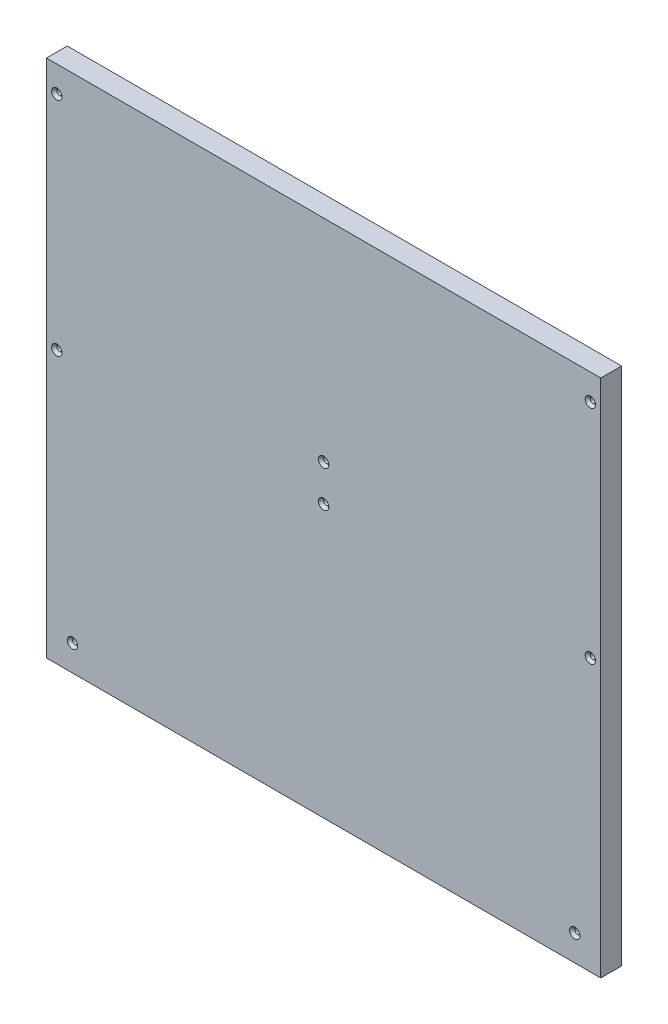
ISO-10303-21;
HEADER;
FILE_DESCRIPTION(('STEP AP214'),'2;1');
FILE_NAME('part.step','',(''),(''),'','','');
FILE_SCHEMA(('AUTOMOTIVE_DESIGN { 1 0 10303 214 1 1 1 1 }'));
ENDSEC;
DATA;
#1=APPLICATION_CONTEXT('core data for automotive mechanical design processes');
#2=APPLICATION_PROTOCOL_DEFINITION('international standard','automotive_design',2000,#1);
#3=PRODUCT_CONTEXT('',#1,'mechanical');
#4=PRODUCT('Part','Part','',(#3));
#5=PRODUCT_RELATED_PRODUCT_CATEGORY('part','',(#4));
#6=PRODUCT_DEFINITION_FORMATION('','',#4);
#7=PRODUCT_DEFINITION_CONTEXT('part definition',#1,'design');
#8=PRODUCT_DEFINITION('design','',#6,#7);
#9=PRODUCT_DEFINITION_SHAPE('','',#8);
#10=(LENGTH_UNIT() NAMED_UNIT(*) SI_UNIT(.MILLI.,.METRE.));
#11=(NAMED_UNIT(*) PLANE_ANGLE_UNIT() SI_UNIT($,.RADIAN.));
#12=(NAMED_UNIT(*) SI_UNIT($,.STERADIAN.) SOLID_ANGLE_UNIT());
#13=UNCERTAINTY_MEASURE_WITH_UNIT(LENGTH_MEASURE(1.E-05),#10,'distance_accuracy_value','');
#14=(GEOMETRIC_REPRESENTATION_CONTEXT(3) GLOBAL_UNCERTAINTY_ASSIGNED_CONTEXT((#13)) GLOBAL_UNIT_ASSIGNED_CONTEXT((#10,
#11,#12)) REPRESENTATION_CONTEXT('',''));
#15=CARTESIAN_POINT('',(0.,0.,0.));
#16=DIRECTION('',(0.,0.,1.));
#17=DIRECTION('',(1.,0.,0.));
#18=AXIS2_PLACEMENT_3D('',#15,#16,#17);
#19=CARTESIAN_POINT('',(0.,0.,12.));
#20=DIRECTION('',(0.,0.,1.));
#21=DIRECTION('',(1.,0.,0.));
#22=AXIS2_PLACEMENT_3D('',#19,#20,#21);
#23=PLANE('',#22);
#24=CARTESIAN_POINT('',(14.5077720207254,97.7253886010362,12.));
#25=DIRECTION('',(0.,0.,1.));
#26=DIRECTION('',(1.,0.,0.));
#27=AXIS2_PLACEMENT_3D('',#24,#25,#26);
#28=CIRCLE('',#27,3.);
#29=CARTESIAN_POINT('',(17.5077720207254,97.7253886010362,12.));
#30=VERTEX_POINT('',#29);
#31=EDGE_CURVE('E388',#30,#30,#28,.T.);
#32=ORIENTED_EDGE('',*,*,#31,.F.);
#33=EDGE_LOOP('',(#32));
#34=FACE_BOUND('',#33,.T.);
#35=CARTESIAN_POINT('',(159.507772020725,-44.2746113989638,12.));
#36=DIRECTION('',(0.,0.,1.));
#37=DIRECTION('',(1.,0.,0.));
#38=AXIS2_PLACEMENT_3D('',#35,#36,#37);
#39=CIRCLE('',#38,2.99999999999999);
#40=CARTESIAN_POINT('',(162.507772020725,-44.2746113989638,12.));
#41=VERTEX_POINT('',#40);
#42=EDGE_CURVE('E385',#41,#41,#39,.T.);
#43=ORIENTED_EDGE('',*,*,#42,.F.);
#44=EDGE_LOOP('',(#43));
#45=FACE_BOUND('',#44,.T.);
#46=CARTESIAN_POINT('',(-130.492227979275,-44.2746113989638,12.));
#47=DIRECTION('',(0.,0.,1.));
#48=DIRECTION('',(1.,0.,0.));
#49=AXIS2_PLACEMENT_3D('',#46,#47,#48);
#50=CIRCLE('',#49,2.99999999999999);
#51=CARTESIAN_POINT('',(-127.492227979275,-44.2746113989638,12.));
#52=VERTEX_POINT('',#51);
#53=EDGE_CURVE('E389',#52,#52,#50,.T.);
#54=ORIENTED_EDGE('',*,*,#53,.F.);
#55=EDGE_LOOP('',(#54));
#56=FACE_BOUND('',#55,.T.);
#57=CARTESIAN_POINT('',(14.5077720207254,118.725388601036,12.));
#58=DIRECTION('',(0.,0.,1.));
#59=DIRECTION('',(1.,0.,0.));
#60=AXIS2_PLACEMENT_3D('',#57,#58,#59);
#61=CIRCLE('',#60,3.);
#62=CARTESIAN_POINT('',(17.5077720207254,118.725388601036,12.));
#63=VERTEX_POINT('',#62);
#64=EDGE_CURVE('E392',#63,#63,#61,.T.);
#65=ORIENTED_EDGE('',*,*,#64,.F.);
#66=EDGE_LOOP('',(#65));
#67=FACE_BOUND('',#66,.T.);
#68=CARTESIAN_POINT('',(168.507772020725,97.7253886010362,12.));
#69=DIRECTION('',(0.,0.,1.));
#70=DIRECTION('',(1.,0.,0.));
#71=AXIS2_PLACEMENT_3D('',#68,#69,#70);
#72=CIRCLE('',#71,2.99999999999999);
#73=CARTESIAN_POINT('',(171.507772020725,97.7253886010362,12.));
#74=VERTEX_POINT('',#73);
#75=EDGE_CURVE('E140',#74,#74,#72,.T.);
#76=ORIENTED_EDGE('',*,*,#75,.F.);
#77=EDGE_LOOP('',(#76));
#78=FACE_BOUND('',#77,.T.);
#79=CARTESIAN_POINT('',(168.507772020725,225.725388601036,12.));
#80=DIRECTION('',(0.,0.,1.));
#81=DIRECTION('',(1.,0.,0.));
#82=AXIS2_PLACEMENT_3D('',#79,#80,#81);
#83=CIRCLE('',#82,2.99999999999999);
#84=CARTESIAN_POINT('',(171.507772020725,225.725388601036,12.));
#85=VERTEX_POINT('',#84);
#86=EDGE_CURVE('E381',#85,#85,#83,.T.);
#87=ORIENTED_EDGE('',*,*,#86,.F.);
#88=EDGE_LOOP('',(#87));
#89=FACE_BOUND('',#88,.T.);
#90=CARTESIAN_POINT('',(-139.492227979275,97.7253886010362,12.));
#91=DIRECTION('',(0.,0.,1.));
#92=DIRECTION('',(1.,0.,0.));
#93=AXIS2_PLACEMENT_3D('',#90,#91,#92);
#94=CIRCLE('',#93,2.99999999999999);
#95=CARTESIAN_POINT('',(-136.492227979275,97.7253886010362,12.));
#96=VERTEX_POINT('',#95);
#97=EDGE_CURVE('E116',#96,#96,#94,.T.);
#98=ORIENTED_EDGE('',*,*,#97,.F.);
#99=EDGE_LOOP('',(#98));
#100=FACE_BOUND('',#99,.T.);
#101=CARTESIAN_POINT('',(-139.492227979275,225.725388601036,12.));
#102=DIRECTION('',(0.,0.,1.));
#103=DIRECTION('',(1.,0.,0.));
#104=AXIS2_PLACEMENT_3D('',#101,#102,#103);
#105=CIRCLE('',#104,2.99999999999999);
#106=CARTESIAN_POINT('',(-136.492227979275,225.725388601036,12.));
#107=VERTEX_POINT('',#106);
#108=EDGE_CURVE('E111',#107,#107,#105,.T.);
#109=ORIENTED_EDGE('',*,*,#108,.F.);
#110=EDGE_LOOP('',(#109));
#111=FACE_BOUND('',#110,.T.);
#112=DIRECTION('',(0.,-1.,0.));
#113=VECTOR('',#112,1.);
#114=CARTESIAN_POINT('',(-145.492227979275,240.725388601036,12.));
#115=LINE('',#114,#113);
#116=CARTESIAN_POINT('',(-145.492227979275,240.725388601036,12.));
#117=VERTEX_POINT('',#116);
#118=CARTESIAN_POINT('',(-145.492227979275,-59.2746113989638,12.));
#119=VERTEX_POINT('',#118);
#120=EDGE_CURVE('E85',#117,#119,#115,.T.);
#121=ORIENTED_EDGE('',*,*,#120,.T.);
#122=DIRECTION('',(1.,0.,0.));
#123=VECTOR('',#122,1.);
#124=CARTESIAN_POINT('',(-145.492227979275,-59.2746113989638,12.));
#125=LINE('',#124,#123);
#126=CARTESIAN_POINT('',(174.507772020725,-59.2746113989638,12.));
#127=VERTEX_POINT('',#126);
#128=EDGE_CURVE('E81',#119,#127,#125,.T.);
#129=ORIENTED_EDGE('',*,*,#128,.T.);
#130=DIRECTION('',(0.,1.,0.));
#131=VECTOR('',#130,1.);
#132=CARTESIAN_POINT('',(174.507772020725,240.725388601036,12.));
#133=LINE('',#132,#131);
#134=CARTESIAN_POINT('',(174.507772020725,240.725388601036,12.));
#135=VERTEX_POINT('',#134);
#136=EDGE_CURVE('E83',#127,#135,#133,.T.);
#137=ORIENTED_EDGE('',*,*,#136,.T.);
#138=DIRECTION('',(-1.,0.,0.));
#139=VECTOR('',#138,1.);
#140=CARTESIAN_POINT('',(-145.492227979275,240.725388601036,12.));
#141=LINE('',#140,#139);
#142=EDGE_CURVE('E51',#135,#117,#141,.T.);
#143=ORIENTED_EDGE('',*,*,#142,.T.);
#144=EDGE_LOOP('',(#121,#129,#137,#143));
#145=FACE_BOUND('',#144,.T.);
#146=ADVANCED_FACE('F32',(#34,#45,#56,#67,#78,#89,#100,#111,#145),#23,.T.);
#147=CARTESIAN_POINT('',(0.,0.,0.));
#148=DIRECTION('',(0.,0.,1.));
#149=DIRECTION('',(1.,0.,0.));
#150=AXIS2_PLACEMENT_3D('',#147,#148,#149);
#151=PLANE('',#150);
#152=DIRECTION('',(0.,-1.,0.));
#153=VECTOR('',#152,1.);
#154=CARTESIAN_POINT('',(-145.492227979275,240.725388601036,0.));
#155=LINE('',#154,#153);
#156=CARTESIAN_POINT('',(-145.492227979275,240.725388601036,0.));
#157=VERTEX_POINT('',#156);
#158=CARTESIAN_POINT('',(-145.492227979275,-59.2746113989638,0.));
#159=VERTEX_POINT('',#158);
#160=EDGE_CURVE('E98',#157,#159,#155,.T.);
#161=ORIENTED_EDGE('',*,*,#160,.F.);
#162=DIRECTION('',(-1.,0.,0.));
#163=VECTOR('',#162,1.);
#164=CARTESIAN_POINT('',(-145.492227979275,240.725388601036,0.));
#165=LINE('',#164,#163);
#166=CARTESIAN_POINT('',(174.507772020725,240.725388601036,0.));
#167=VERTEX_POINT('',#166);
#168=EDGE_CURVE('E74',#167,#157,#165,.T.);
#169=ORIENTED_EDGE('',*,*,#168,.F.);
#170=DIRECTION('',(0.,1.,0.));
#171=VECTOR('',#170,1.);
#172=CARTESIAN_POINT('',(174.507772020725,240.725388601036,0.));
#173=LINE('',#172,#171);
#174=CARTESIAN_POINT('',(174.507772020725,-59.2746113989638,0.));
#175=VERTEX_POINT('',#174);
#176=EDGE_CURVE('E68',#175,#167,#173,.T.);
#177=ORIENTED_EDGE('',*,*,#176,.F.);
#178=DIRECTION('',(1.,0.,0.));
#179=VECTOR('',#178,1.);
#180=CARTESIAN_POINT('',(-145.492227979275,-59.2746113989638,0.));
#181=LINE('',#180,#179);
#182=EDGE_CURVE('E89',#159,#175,#181,.T.);
#183=ORIENTED_EDGE('',*,*,#182,.F.);
#184=EDGE_LOOP('',(#161,#169,#177,#183));
#185=FACE_BOUND('',#184,.T.);
#186=CARTESIAN_POINT('',(-139.492227979275,225.725388601036,0.));
#187=DIRECTION('',(0.,0.,1.));
#188=DIRECTION('',(1.,0.,0.));
#189=AXIS2_PLACEMENT_3D('',#186,#187,#188);
#190=CIRCLE('',#189,1.5);
#191=CARTESIAN_POINT('',(-137.992227979275,225.725388601036,0.));
#192=VERTEX_POINT('',#191);
#193=EDGE_CURVE('E101',#192,#192,#190,.T.);
#194=ORIENTED_EDGE('',*,*,#193,.T.);
#195=EDGE_LOOP('',(#194));
#196=FACE_BOUND('',#195,.T.);
#197=CARTESIAN_POINT('',(-139.492227979275,97.7253886010362,0.));
#198=DIRECTION('',(0.,0.,1.));
#199=DIRECTION('',(1.,0.,0.));
#200=AXIS2_PLACEMENT_3D('',#197,#198,#199);
#201=CIRCLE('',#200,1.5);
#202=CARTESIAN_POINT('',(-137.992227979275,97.7253886010362,0.));
#203=VERTEX_POINT('',#202);
#204=EDGE_CURVE('E159',#203,#203,#201,.T.);
#205=ORIENTED_EDGE('',*,*,#204,.T.);
#206=EDGE_LOOP('',(#205));
#207=FACE_BOUND('',#206,.T.);
#208=CARTESIAN_POINT('',(168.507772020725,225.725388601036,0.));
#209=DIRECTION('',(0.,0.,1.));
#210=DIRECTION('',(1.,0.,0.));
#211=AXIS2_PLACEMENT_3D('',#208,#209,#210);
#212=CIRCLE('',#211,1.5);
#213=CARTESIAN_POINT('',(170.007772020725,225.725388601036,0.));
#214=VERTEX_POINT('',#213);
#215=EDGE_CURVE('E156',#214,#214,#212,.T.);
#216=ORIENTED_EDGE('',*,*,#215,.T.);
#217=EDGE_LOOP('',(#216));
#218=FACE_BOUND('',#217,.T.);
#219=CARTESIAN_POINT('',(168.507772020725,97.7253886010362,0.));
#220=DIRECTION('',(0.,0.,1.));
#221=DIRECTION('',(1.,0.,0.));
#222=AXIS2_PLACEMENT_3D('',#219,#220,#221);
#223=CIRCLE('',#222,1.5);
#224=CARTESIAN_POINT('',(170.007772020725,97.7253886010362,0.));
#225=VERTEX_POINT('',#224);
#226=EDGE_CURVE('E153',#225,#225,#223,.T.);
#227=ORIENTED_EDGE('',*,*,#226,.T.);
#228=EDGE_LOOP('',(#227));
#229=FACE_BOUND('',#228,.T.);
#230=CARTESIAN_POINT('',(-130.492227979275,-44.2746113989638,0.));
#231=DIRECTION('',(0.,0.,1.));
#232=DIRECTION('',(1.,0.,0.));
#233=AXIS2_PLACEMENT_3D('',#230,#231,#232);
#234=CIRCLE('',#233,1.5);
#235=CARTESIAN_POINT('',(-128.992227979275,-44.2746113989638,0.));
#236=VERTEX_POINT('',#235);
#237=EDGE_CURVE('E150',#236,#236,#234,.T.);
#238=ORIENTED_EDGE('',*,*,#237,.T.);
#239=EDGE_LOOP('',(#238));
#240=FACE_BOUND('',#239,.T.);
#241=CARTESIAN_POINT('',(159.507772020725,-44.2746113989638,0.));
#242=DIRECTION('',(0.,0.,1.));
#243=DIRECTION('',(1.,0.,0.));
#244=AXIS2_PLACEMENT_3D('',#241,#242,#243);
#245=CIRCLE('',#244,1.5);
#246=CARTESIAN_POINT('',(161.007772020725,-44.2746113989638,0.));
#247=VERTEX_POINT('',#246);
#248=EDGE_CURVE('E147',#247,#247,#245,.T.);
#249=ORIENTED_EDGE('',*,*,#248,.T.);
#250=EDGE_LOOP('',(#249));
#251=FACE_BOUND('',#250,.T.);
#252=CARTESIAN_POINT('',(14.5077720207254,97.7253886010362,0.));
#253=DIRECTION('',(0.,0.,1.));
#254=DIRECTION('',(1.,0.,0.));
#255=AXIS2_PLACEMENT_3D('',#252,#253,#254);
#256=CIRCLE('',#255,1.5);
#257=CARTESIAN_POINT('',(16.0077720207254,97.7253886010362,0.));
#258=VERTEX_POINT('',#257);
#259=EDGE_CURVE('E144',#258,#258,#256,.T.);
#260=ORIENTED_EDGE('',*,*,#259,.T.);
#261=EDGE_LOOP('',(#260));
#262=FACE_BOUND('',#261,.T.);
#263=CARTESIAN_POINT('',(14.5077720207254,118.725388601036,0.));
#264=DIRECTION('',(0.,0.,1.));
#265=DIRECTION('',(1.,0.,0.));
#266=AXIS2_PLACEMENT_3D('',#263,#264,#265);
#267=CIRCLE('',#266,1.5);
#268=CARTESIAN_POINT('',(16.0077720207254,118.725388601036,0.));
#269=VERTEX_POINT('',#268);
#270=EDGE_CURVE('E110',#269,#269,#267,.T.);
#271=ORIENTED_EDGE('',*,*,#270,.T.);
#272=EDGE_LOOP('',(#271));
#273=FACE_BOUND('',#272,.T.);
#274=ADVANCED_FACE('F165',(#185,#196,#207,#218,#229,#240,#251,#262,#273),#151,.F.);
#275=CARTESIAN_POINT('',(-145.492227979275,240.725388601036,12.));
#276=DIRECTION('',(1.,0.,0.));
#277=DIRECTION('',(0.,1.,0.));
#278=AXIS2_PLACEMENT_3D('',#275,#276,#277);
#279=PLANE('',#278);
#280=ORIENTED_EDGE('',*,*,#160,.T.);
#281=DIRECTION('',(0.,0.,-1.));
#282=VECTOR('',#281,1.);
#283=CARTESIAN_POINT('',(-145.492227979275,-59.2746113989638,12.));
#284=LINE('',#283,#282);
#285=EDGE_CURVE('E11',#119,#159,#284,.T.);
#286=ORIENTED_EDGE('',*,*,#285,.F.);
#287=ORIENTED_EDGE('',*,*,#120,.F.);
#288=DIRECTION('',(0.,0.,-1.));
#289=VECTOR('',#288,1.);
#290=CARTESIAN_POINT('',(-145.492227979275,240.725388601036,12.));
#291=LINE('',#290,#289);
#292=EDGE_CURVE('E94',#117,#157,#291,.T.);
#293=ORIENTED_EDGE('',*,*,#292,.T.);
#294=EDGE_LOOP('',(#280,#286,#287,#293));
#295=FACE_BOUND('',#294,.T.);
#296=ADVANCED_FACE('F34',(#295),#279,.F.);
#297=CARTESIAN_POINT('',(-145.492227979275,-59.2746113989638,12.));
#298=DIRECTION('',(0.,1.,0.));
#299=DIRECTION('',(0.,0.,1.));
#300=AXIS2_PLACEMENT_3D('',#297,#298,#299);
#301=PLANE('',#300);
#302=ORIENTED_EDGE('',*,*,#182,.T.);
#303=DIRECTION('',(0.,0.,-1.));
#304=VECTOR('',#303,1.);
#305=CARTESIAN_POINT('',(174.507772020725,-59.2746113989638,12.));
#306=LINE('',#305,#304);
#307=EDGE_CURVE('E42',#127,#175,#306,.T.);
#308=ORIENTED_EDGE('',*,*,#307,.F.);
#309=ORIENTED_EDGE('',*,*,#128,.F.);
#310=ORIENTED_EDGE('',*,*,#285,.T.);
#311=EDGE_LOOP('',(#302,#308,#309,#310));
#312=FACE_BOUND('',#311,.T.);
#313=ADVANCED_FACE('F88',(#312),#301,.F.);
#314=CARTESIAN_POINT('',(174.507772020725,240.725388601036,12.));
#315=DIRECTION('',(-1.,0.,0.));
#316=DIRECTION('',(0.,0.,1.));
#317=AXIS2_PLACEMENT_3D('',#314,#315,#316);
#318=PLANE('',#317);
#319=ORIENTED_EDGE('',*,*,#176,.T.);
#320=DIRECTION('',(0.,0.,-1.));
#321=VECTOR('',#320,1.);
#322=CARTESIAN_POINT('',(174.507772020725,240.725388601036,12.));
#323=LINE('',#322,#321);
#324=EDGE_CURVE('E90',#135,#167,#323,.T.);
#325=ORIENTED_EDGE('',*,*,#324,.F.);
#326=ORIENTED_EDGE('',*,*,#136,.F.);
#327=ORIENTED_EDGE('',*,*,#307,.T.);
#328=EDGE_LOOP('',(#319,#325,#326,#327));
#329=FACE_BOUND('',#328,.T.);
#330=ADVANCED_FACE('F92',(#329),#318,.F.);
#331=CARTESIAN_POINT('',(-145.492227979275,240.725388601036,12.));
#332=DIRECTION('',(0.,-1.,0.));
#333=DIRECTION('',(0.,0.,-1.));
#334=AXIS2_PLACEMENT_3D('',#331,#332,#333);
#335=PLANE('',#334);
#336=ORIENTED_EDGE('',*,*,#168,.T.);
#337=ORIENTED_EDGE('',*,*,#292,.F.);
#338=ORIENTED_EDGE('',*,*,#142,.F.);
#339=ORIENTED_EDGE('',*,*,#324,.T.);
#340=EDGE_LOOP('',(#336,#337,#338,#339));
#341=FACE_BOUND('',#340,.T.);
#342=ADVANCED_FACE('F171',(#341),#335,.F.);
#343=CARTESIAN_POINT('',(-139.492227979275,225.725388601036,12.));
#344=DIRECTION('',(0.,0.,-1.));
#345=DIRECTION('',(-1.,0.,0.));
#346=AXIS2_PLACEMENT_3D('',#343,#344,#345);
#347=CYLINDRICAL_SURFACE('',#346,1.5);
#348=CARTESIAN_POINT('',(-139.492227979275,225.725388601036,10.5));
#349=DIRECTION('',(0.,0.,1.));
#350=DIRECTION('',(1.,0.,0.));
#351=AXIS2_PLACEMENT_3D('',#348,#349,#350);
#352=CIRCLE('',#351,1.5);
#353=CARTESIAN_POINT('',(-137.992227979275,225.725388601036,10.5));
#354=VERTEX_POINT('',#353);
#355=EDGE_CURVE('E107',#354,#354,#352,.F.);
#356=ORIENTED_EDGE('',*,*,#355,.F.);
#357=EDGE_LOOP('',(#356));
#358=FACE_BOUND('',#357,.T.);
#359=ORIENTED_EDGE('',*,*,#193,.F.);
#360=EDGE_LOOP('',(#359));
#361=FACE_BOUND('',#360,.T.);
#362=ADVANCED_FACE('F168',(#358,#361),#347,.F.);
#363=CARTESIAN_POINT('',(-139.492227979275,97.7253886010362,12.));
#364=DIRECTION('',(0.,0.,-1.));
#365=DIRECTION('',(-1.,0.,0.));
#366=AXIS2_PLACEMENT_3D('',#363,#364,#365);
#367=CYLINDRICAL_SURFACE('',#366,1.5);
#368=CARTESIAN_POINT('',(-139.492227979275,97.7253886010362,10.5));
#369=DIRECTION('',(0.,0.,1.));
#370=DIRECTION('',(1.,0.,0.));
#371=AXIS2_PLACEMENT_3D('',#368,#369,#370);
#372=CIRCLE('',#371,1.5);
#373=CARTESIAN_POINT('',(-137.992227979275,97.7253886010362,10.5));
#374=VERTEX_POINT('',#373);
#375=EDGE_CURVE('E36',#374,#374,#372,.F.);
#376=ORIENTED_EDGE('',*,*,#375,.F.);
#377=EDGE_LOOP('',(#376));
#378=FACE_BOUND('',#377,.T.);
#379=ORIENTED_EDGE('',*,*,#204,.F.);
#380=EDGE_LOOP('',(#379));
#381=FACE_BOUND('',#380,.T.);
#382=ADVANCED_FACE('F170',(#378,#381),#367,.F.);
#383=CARTESIAN_POINT('',(168.507772020725,225.725388601036,12.));
#384=DIRECTION('',(0.,0.,-1.));
#385=DIRECTION('',(-1.,0.,0.));
#386=AXIS2_PLACEMENT_3D('',#383,#384,#385);
#387=CYLINDRICAL_SURFACE('',#386,1.5);
#388=CARTESIAN_POINT('',(168.507772020725,225.725388601036,10.5));
#389=DIRECTION('',(0.,0.,1.));
#390=DIRECTION('',(1.,0.,0.));
#391=AXIS2_PLACEMENT_3D('',#388,#389,#390);
#392=CIRCLE('',#391,1.5);
#393=CARTESIAN_POINT('',(170.007772020725,225.725388601036,10.5));
#394=VERTEX_POINT('',#393);
#395=EDGE_CURVE('E127',#394,#394,#392,.F.);
#396=ORIENTED_EDGE('',*,*,#395,.F.);
#397=EDGE_LOOP('',(#396));
#398=FACE_BOUND('',#397,.T.);
#399=ORIENTED_EDGE('',*,*,#215,.F.);
#400=EDGE_LOOP('',(#399));
#401=FACE_BOUND('',#400,.T.);
#402=ADVANCED_FACE('F178',(#398,#401),#387,.F.);
#403=CARTESIAN_POINT('',(168.507772020725,97.7253886010362,12.));
#404=DIRECTION('',(0.,0.,-1.));
#405=DIRECTION('',(-1.,0.,0.));
#406=AXIS2_PLACEMENT_3D('',#403,#404,#405);
#407=CYLINDRICAL_SURFACE('',#406,1.5);
#408=CARTESIAN_POINT('',(168.507772020725,97.7253886010362,10.5));
#409=DIRECTION('',(0.,0.,1.));
#410=DIRECTION('',(1.,0.,0.));
#411=AXIS2_PLACEMENT_3D('',#408,#409,#410);
#412=CIRCLE('',#411,1.5);
#413=CARTESIAN_POINT('',(170.007772020725,97.7253886010362,10.5));
#414=VERTEX_POINT('',#413);
#415=EDGE_CURVE('E125',#414,#414,#412,.F.);
#416=ORIENTED_EDGE('',*,*,#415,.F.);
#417=EDGE_LOOP('',(#416));
#418=FACE_BOUND('',#417,.T.);
#419=ORIENTED_EDGE('',*,*,#226,.F.);
#420=EDGE_LOOP('',(#419));
#421=FACE_BOUND('',#420,.T.);
#422=ADVANCED_FACE('F245',(#418,#421),#407,.F.);
#423=CARTESIAN_POINT('',(-130.492227979275,-44.2746113989638,12.));
#424=DIRECTION('',(0.,0.,-1.));
#425=DIRECTION('',(-1.,0.,0.));
#426=AXIS2_PLACEMENT_3D('',#423,#424,#425);
#427=CYLINDRICAL_SURFACE('',#426,1.5);
#428=CARTESIAN_POINT('',(-130.492227979275,-44.2746113989638,10.5));
#429=DIRECTION('',(0.,0.,1.));
#430=DIRECTION('',(1.,0.,0.));
#431=AXIS2_PLACEMENT_3D('',#428,#429,#430);
#432=CIRCLE('',#431,1.5);
#433=CARTESIAN_POINT('',(-128.992227979275,-44.2746113989638,10.5));
#434=VERTEX_POINT('',#433);
#435=EDGE_CURVE('E122',#434,#434,#432,.F.);
#436=ORIENTED_EDGE('',*,*,#435,.F.);
#437=EDGE_LOOP('',(#436));
#438=FACE_BOUND('',#437,.T.);
#439=ORIENTED_EDGE('',*,*,#237,.F.);
#440=EDGE_LOOP('',(#439));
#441=FACE_BOUND('',#440,.T.);
#442=ADVANCED_FACE('F254',(#438,#441),#427,.F.);
#443=CARTESIAN_POINT('',(159.507772020725,-44.2746113989638,12.));
#444=DIRECTION('',(0.,0.,-1.));
#445=DIRECTION('',(-1.,0.,0.));
#446=AXIS2_PLACEMENT_3D('',#443,#444,#445);
#447=CYLINDRICAL_SURFACE('',#446,1.5);
#448=CARTESIAN_POINT('',(159.507772020725,-44.2746113989638,10.5));
#449=DIRECTION('',(0.,0.,1.));
#450=DIRECTION('',(1.,0.,0.));
#451=AXIS2_PLACEMENT_3D('',#448,#449,#450);
#452=CIRCLE('',#451,1.5);
#453=CARTESIAN_POINT('',(161.007772020725,-44.2746113989638,10.5));
#454=VERTEX_POINT('',#453);
#455=EDGE_CURVE('E119',#454,#454,#452,.F.);
#456=ORIENTED_EDGE('',*,*,#455,.F.);
#457=EDGE_LOOP('',(#456));
#458=FACE_BOUND('',#457,.T.);
#459=ORIENTED_EDGE('',*,*,#248,.F.);
#460=EDGE_LOOP('',(#459));
#461=FACE_BOUND('',#460,.T.);
#462=ADVANCED_FACE('F263',(#458,#461),#447,.F.);
#463=CARTESIAN_POINT('',(14.5077720207254,97.7253886010362,12.));
#464=DIRECTION('',(0.,0.,-1.));
#465=DIRECTION('',(-1.,0.,0.));
#466=AXIS2_PLACEMENT_3D('',#463,#464,#465);
#467=CYLINDRICAL_SURFACE('',#466,1.5);
#468=CARTESIAN_POINT('',(14.5077720207254,97.7253886010362,10.5));
#469=DIRECTION('',(0.,0.,1.));
#470=DIRECTION('',(1.,0.,0.));
#471=AXIS2_PLACEMENT_3D('',#468,#469,#470);
#472=CIRCLE('',#471,1.5);
#473=CARTESIAN_POINT('',(16.0077720207254,97.7253886010362,10.5));
#474=VERTEX_POINT('',#473);
#475=EDGE_CURVE('E115',#474,#474,#472,.F.);
#476=ORIENTED_EDGE('',*,*,#475,.F.);
#477=EDGE_LOOP('',(#476));
#478=FACE_BOUND('',#477,.T.);
#479=ORIENTED_EDGE('',*,*,#259,.F.);
#480=EDGE_LOOP('',(#479));
#481=FACE_BOUND('',#480,.T.);
#482=ADVANCED_FACE('F272',(#478,#481),#467,.F.);
#483=CARTESIAN_POINT('',(14.5077720207254,118.725388601036,12.));
#484=DIRECTION('',(0.,0.,-1.));
#485=DIRECTION('',(-1.,0.,0.));
#486=AXIS2_PLACEMENT_3D('',#483,#484,#485);
#487=CYLINDRICAL_SURFACE('',#486,1.5);
#488=CARTESIAN_POINT('',(14.5077720207254,118.725388601036,10.5));
#489=DIRECTION('',(0.,0.,1.));
#490=DIRECTION('',(1.,0.,0.));
#491=AXIS2_PLACEMENT_3D('',#488,#489,#490);
#492=CIRCLE('',#491,1.5);
#493=CARTESIAN_POINT('',(16.0077720207254,118.725388601036,10.5));
#494=VERTEX_POINT('',#493);
#495=EDGE_CURVE('E112',#494,#494,#492,.F.);
#496=ORIENTED_EDGE('',*,*,#495,.F.);
#497=EDGE_LOOP('',(#496));
#498=FACE_BOUND('',#497,.T.);
#499=ORIENTED_EDGE('',*,*,#270,.F.);
#500=EDGE_LOOP('',(#499));
#501=FACE_BOUND('',#500,.T.);
#502=ADVANCED_FACE('F281',(#498,#501),#487,.F.);
#503=CARTESIAN_POINT('',(-139.492227979275,225.725388601036,12.));
#504=DIRECTION('',(0.,0.,1.));
#505=DIRECTION('',(1.,0.,0.));
#506=AXIS2_PLACEMENT_3D('',#503,#504,#505);
#507=CONICAL_SURFACE('',#506,2.99999999999999,0.78539816339745);
#508=ORIENTED_EDGE('',*,*,#355,.T.);
#509=EDGE_LOOP('',(#508));
#510=FACE_BOUND('',#509,.T.);
#511=ORIENTED_EDGE('',*,*,#108,.T.);
#512=EDGE_LOOP('',(#511));
#513=FACE_BOUND('',#512,.T.);
#514=ADVANCED_FACE('F290',(#510,#513),#507,.F.);
#515=CARTESIAN_POINT('',(14.5077720207254,118.725388601036,12.));
#516=DIRECTION('',(0.,0.,1.));
#517=DIRECTION('',(1.,0.,0.));
#518=AXIS2_PLACEMENT_3D('',#515,#516,#517);
#519=CONICAL_SURFACE('',#518,3.,0.78539816339745);
#520=ORIENTED_EDGE('',*,*,#495,.T.);
#521=EDGE_LOOP('',(#520));
#522=FACE_BOUND('',#521,.T.);
#523=ORIENTED_EDGE('',*,*,#64,.T.);
#524=EDGE_LOOP('',(#523));
#525=FACE_BOUND('',#524,.T.);
#526=ADVANCED_FACE('F299',(#522,#525),#519,.F.);
#527=CARTESIAN_POINT('',(14.5077720207254,97.7253886010362,12.));
#528=DIRECTION('',(0.,0.,1.));
#529=DIRECTION('',(1.,0.,0.));
#530=AXIS2_PLACEMENT_3D('',#527,#528,#529);
#531=CONICAL_SURFACE('',#530,3.,0.78539816339745);
#532=ORIENTED_EDGE('',*,*,#475,.T.);
#533=EDGE_LOOP('',(#532));
#534=FACE_BOUND('',#533,.T.);
#535=ORIENTED_EDGE('',*,*,#31,.T.);
#536=EDGE_LOOP('',(#535));
#537=FACE_BOUND('',#536,.T.);
#538=ADVANCED_FACE('F308',(#534,#537),#531,.F.);
#539=CARTESIAN_POINT('',(159.507772020725,-44.2746113989638,12.));
#540=DIRECTION('',(0.,0.,1.));
#541=DIRECTION('',(1.,0.,0.));
#542=AXIS2_PLACEMENT_3D('',#539,#540,#541);
#543=CONICAL_SURFACE('',#542,2.99999999999999,0.78539816339745);
#544=ORIENTED_EDGE('',*,*,#455,.T.);
#545=EDGE_LOOP('',(#544));
#546=FACE_BOUND('',#545,.T.);
#547=ORIENTED_EDGE('',*,*,#42,.T.);
#548=EDGE_LOOP('',(#547));
#549=FACE_BOUND('',#548,.T.);
#550=ADVANCED_FACE('F317',(#546,#549),#543,.F.);
#551=CARTESIAN_POINT('',(-130.492227979275,-44.2746113989638,12.));
#552=DIRECTION('',(0.,0.,1.));
#553=DIRECTION('',(1.,0.,0.));
#554=AXIS2_PLACEMENT_3D('',#551,#552,#553);
#555=CONICAL_SURFACE('',#554,2.99999999999999,0.78539816339745);
#556=ORIENTED_EDGE('',*,*,#435,.T.);
#557=EDGE_LOOP('',(#556));
#558=FACE_BOUND('',#557,.T.);
#559=ORIENTED_EDGE('',*,*,#53,.T.);
#560=EDGE_LOOP('',(#559));
#561=FACE_BOUND('',#560,.T.);
#562=ADVANCED_FACE('F326',(#558,#561),#555,.F.);
#563=CARTESIAN_POINT('',(168.507772020725,97.7253886010362,12.));
#564=DIRECTION('',(0.,0.,1.));
#565=DIRECTION('',(1.,0.,0.));
#566=AXIS2_PLACEMENT_3D('',#563,#564,#565);
#567=CONICAL_SURFACE('',#566,2.99999999999999,0.78539816339745);
#568=ORIENTED_EDGE('',*,*,#415,.T.);
#569=EDGE_LOOP('',(#568));
#570=FACE_BOUND('',#569,.T.);
#571=ORIENTED_EDGE('',*,*,#75,.T.);
#572=EDGE_LOOP('',(#571));
#573=FACE_BOUND('',#572,.T.);
#574=ADVANCED_FACE('F335',(#570,#573),#567,.F.);
#575=CARTESIAN_POINT('',(168.507772020725,225.725388601036,12.));
#576=DIRECTION('',(0.,0.,1.));
#577=DIRECTION('',(1.,0.,0.));
#578=AXIS2_PLACEMENT_3D('',#575,#576,#577);
#579=CONICAL_SURFACE('',#578,2.99999999999999,0.78539816339745);
#580=ORIENTED_EDGE('',*,*,#395,.T.);
#581=EDGE_LOOP('',(#580));
#582=FACE_BOUND('',#581,.T.);
#583=ORIENTED_EDGE('',*,*,#86,.T.);
#584=EDGE_LOOP('',(#583));
#585=FACE_BOUND('',#584,.T.);
#586=ADVANCED_FACE('F344',(#582,#585),#579,.F.);
#587=CARTESIAN_POINT('',(-139.492227979275,97.7253886010362,12.));
#588=DIRECTION('',(0.,0.,1.));
#589=DIRECTION('',(1.,0.,0.));
#590=AXIS2_PLACEMENT_3D('',#587,#588,#589);
#591=CONICAL_SURFACE('',#590,2.99999999999999,0.78539816339745);
#592=ORIENTED_EDGE('',*,*,#375,.T.);
#593=EDGE_LOOP('',(#592));
#594=FACE_BOUND('',#593,.T.);
#595=ORIENTED_EDGE('',*,*,#97,.T.);
#596=EDGE_LOOP('',(#595));
#597=FACE_BOUND('',#596,.T.);
#598=ADVANCED_FACE('F353',(#594,#597),#591,.F.);
#599=CLOSED_SHELL('',(#146,#274,#296,#313,#330,#342,#362,#382,#402,#422,#442,#462,#482,#502,
#514,#526,#538,#550,#562,#574,#586,#598));
#600=MANIFOLD_SOLID_BREP('B2',#599);
#601=ADVANCED_BREP_SHAPE_REPRESENTATION('',(#18,#600),#14);
#602=SHAPE_DEFINITION_REPRESENTATION(#9,#601);
ENDSEC;
END-ISO-10303-21;
